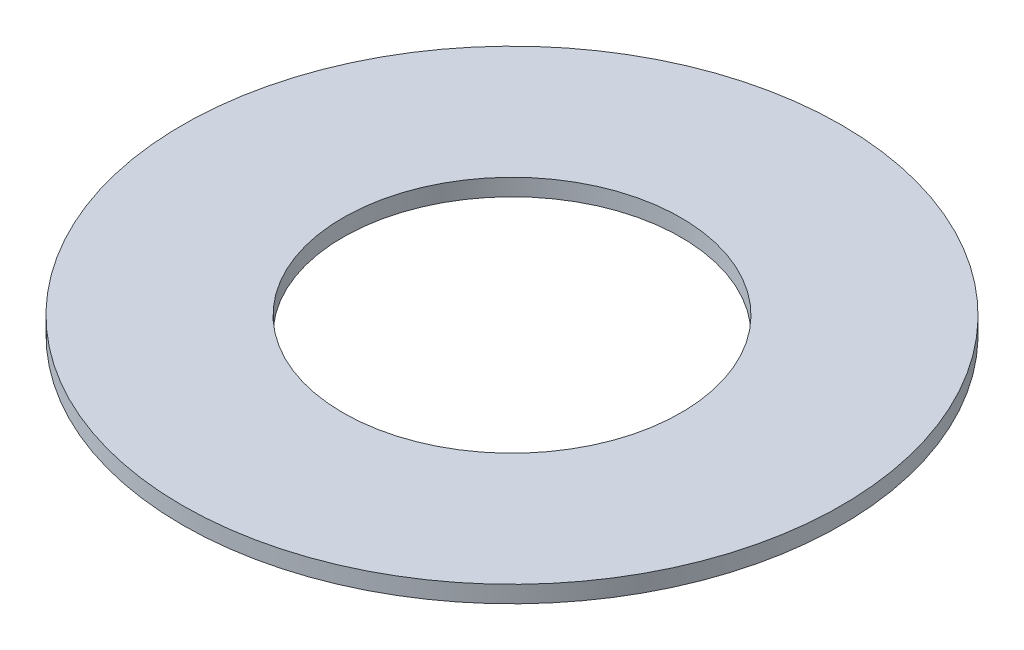
ISO-10303-21;
HEADER;
FILE_DESCRIPTION(('STEP AP214'),'2;1');
FILE_NAME('part.step','',(''),(''),'','','');
FILE_SCHEMA(('AUTOMOTIVE_DESIGN { 1 0 10303 214 1 1 1 1 }'));
ENDSEC;
DATA;
#1=APPLICATION_CONTEXT('core data for automotive mechanical design processes');
#2=APPLICATION_PROTOCOL_DEFINITION('international standard','automotive_design',2000,#1);
#3=PRODUCT_CONTEXT('',#1,'mechanical');
#4=PRODUCT('Part','Part','',(#3));
#5=PRODUCT_RELATED_PRODUCT_CATEGORY('part','',(#4));
#6=PRODUCT_DEFINITION_FORMATION('','',#4);
#7=PRODUCT_DEFINITION_CONTEXT('part definition',#1,'design');
#8=PRODUCT_DEFINITION('design','',#6,#7);
#9=PRODUCT_DEFINITION_SHAPE('','',#8);
#10=(LENGTH_UNIT() NAMED_UNIT(*) SI_UNIT(.MILLI.,.METRE.));
#11=(NAMED_UNIT(*) PLANE_ANGLE_UNIT() SI_UNIT($,.RADIAN.));
#12=(NAMED_UNIT(*) SI_UNIT($,.STERADIAN.) SOLID_ANGLE_UNIT());
#13=UNCERTAINTY_MEASURE_WITH_UNIT(LENGTH_MEASURE(1.E-05),#10,'distance_accuracy_value','');
#14=(GEOMETRIC_REPRESENTATION_CONTEXT(3) GLOBAL_UNCERTAINTY_ASSIGNED_CONTEXT((#13)) GLOBAL_UNIT_ASSIGNED_CONTEXT((#10,
#11,#12)) REPRESENTATION_CONTEXT('',''));
#15=CARTESIAN_POINT('',(0.,0.,0.));
#16=DIRECTION('',(0.,0.,1.));
#17=DIRECTION('',(1.,0.,0.));
#18=AXIS2_PLACEMENT_3D('',#15,#16,#17);
#19=CARTESIAN_POINT('',(0.,0.5,0.));
#20=DIRECTION('',(0.,1.,0.));
#21=DIRECTION('',(0.,0.,1.));
#22=AXIS2_PLACEMENT_3D('',#19,#20,#21);
#23=PLANE('',#22);
#24=CARTESIAN_POINT('',(0.,0.5,0.));
#25=DIRECTION('',(0.,1.,0.));
#26=DIRECTION('',(0.,0.,1.));
#27=AXIS2_PLACEMENT_3D('',#24,#25,#26);
#28=CIRCLE('',#27,9.75);
#29=CARTESIAN_POINT('',(0.,0.5,9.75));
#30=VERTEX_POINT('',#29);
#31=EDGE_CURVE('E10',#30,#30,#28,.T.);
#32=ORIENTED_EDGE('',*,*,#31,.T.);
#33=EDGE_LOOP('',(#32));
#34=FACE_BOUND('',#33,.T.);
#35=CARTESIAN_POINT('',(0.,0.5,0.));
#36=DIRECTION('',(0.,1.,0.));
#37=DIRECTION('',(0.,0.,1.));
#38=AXIS2_PLACEMENT_3D('',#35,#36,#37);
#39=CIRCLE('',#38,5.);
#40=CARTESIAN_POINT('',(0.,0.5,5.));
#41=VERTEX_POINT('',#40);
#42=EDGE_CURVE('E41',#41,#41,#39,.T.);
#43=ORIENTED_EDGE('',*,*,#42,.F.);
#44=EDGE_LOOP('',(#43));
#45=FACE_BOUND('',#44,.T.);
#46=ADVANCED_FACE('F30',(#34,#45),#23,.T.);
#47=CARTESIAN_POINT('',(0.,0.,0.));
#48=DIRECTION('',(0.,1.,0.));
#49=DIRECTION('',(0.,0.,1.));
#50=AXIS2_PLACEMENT_3D('',#47,#48,#49);
#51=PLANE('',#50);
#52=CARTESIAN_POINT('',(0.,0.,0.));
#53=DIRECTION('',(0.,1.,0.));
#54=DIRECTION('',(0.,0.,1.));
#55=AXIS2_PLACEMENT_3D('',#52,#53,#54);
#56=CIRCLE('',#55,9.75);
#57=CARTESIAN_POINT('',(0.,0.,9.75));
#58=VERTEX_POINT('',#57);
#59=EDGE_CURVE('E34',#58,#58,#56,.T.);
#60=ORIENTED_EDGE('',*,*,#59,.F.);
#61=EDGE_LOOP('',(#60));
#62=FACE_BOUND('',#61,.T.);
#63=CARTESIAN_POINT('',(0.,0.,0.));
#64=DIRECTION('',(0.,1.,0.));
#65=DIRECTION('',(0.,0.,1.));
#66=AXIS2_PLACEMENT_3D('',#63,#64,#65);
#67=CIRCLE('',#66,5.);
#68=CARTESIAN_POINT('',(0.,0.,5.));
#69=VERTEX_POINT('',#68);
#70=EDGE_CURVE('E43',#69,#69,#67,.T.);
#71=ORIENTED_EDGE('',*,*,#70,.T.);
#72=EDGE_LOOP('',(#71));
#73=FACE_BOUND('',#72,.T.);
#74=ADVANCED_FACE('F53',(#62,#73),#51,.F.);
#75=CARTESIAN_POINT('',(0.,0.5,0.));
#76=DIRECTION('',(0.,-1.,0.));
#77=DIRECTION('',(0.,0.,-1.));
#78=AXIS2_PLACEMENT_3D('',#75,#76,#77);
#79=CYLINDRICAL_SURFACE('',#78,9.75);
#80=ORIENTED_EDGE('',*,*,#31,.F.);
#81=EDGE_LOOP('',(#80));
#82=FACE_BOUND('',#81,.T.);
#83=ORIENTED_EDGE('',*,*,#59,.T.);
#84=EDGE_LOOP('',(#83));
#85=FACE_BOUND('',#84,.T.);
#86=ADVANCED_FACE('F32',(#82,#85),#79,.T.);
#87=CARTESIAN_POINT('',(0.,0.5,0.));
#88=DIRECTION('',(0.,-1.,0.));
#89=DIRECTION('',(0.,0.,-1.));
#90=AXIS2_PLACEMENT_3D('',#87,#88,#89);
#91=CYLINDRICAL_SURFACE('',#90,5.);
#92=ORIENTED_EDGE('',*,*,#42,.T.);
#93=EDGE_LOOP('',(#92));
#94=FACE_BOUND('',#93,.T.);
#95=ORIENTED_EDGE('',*,*,#70,.F.);
#96=EDGE_LOOP('',(#95));
#97=FACE_BOUND('',#96,.T.);
#98=ADVANCED_FACE('F49',(#94,#97),#91,.F.);
#99=CLOSED_SHELL('',(#46,#74,#86,#98));
#100=MANIFOLD_SOLID_BREP('B2',#99);
#101=ADVANCED_BREP_SHAPE_REPRESENTATION('',(#18,#100),#14);
#102=SHAPE_DEFINITION_REPRESENTATION(#9,#101);
ENDSEC;
END-ISO-10303-21;
